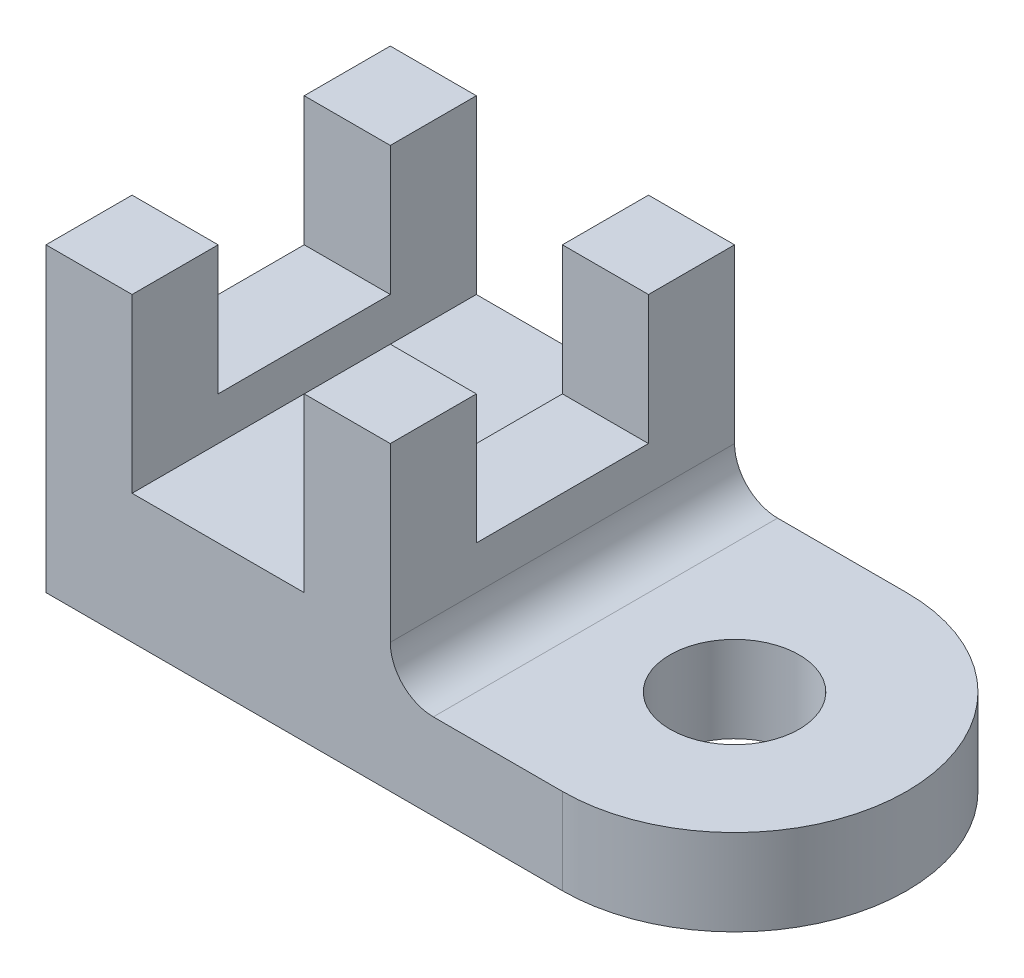
ISO-10303-21;
HEADER;
FILE_DESCRIPTION(('STEP AP214'),'2;1');
FILE_NAME('part.step','',(''),(''),'','','');
FILE_SCHEMA(('AUTOMOTIVE_DESIGN { 1 0 10303 214 1 1 1 1 }'));
ENDSEC;
DATA;
#1=APPLICATION_CONTEXT('core data for automotive mechanical design processes');
#2=APPLICATION_PROTOCOL_DEFINITION('international standard','automotive_design',2000,#1);
#3=PRODUCT_CONTEXT('',#1,'mechanical');
#4=PRODUCT('Part','Part','',(#3));
#5=PRODUCT_RELATED_PRODUCT_CATEGORY('part','',(#4));
#6=PRODUCT_DEFINITION_FORMATION('','',#4);
#7=PRODUCT_DEFINITION_CONTEXT('part definition',#1,'design');
#8=PRODUCT_DEFINITION('design','',#6,#7);
#9=PRODUCT_DEFINITION_SHAPE('','',#8);
#10=(LENGTH_UNIT() NAMED_UNIT(*) SI_UNIT(.MILLI.,.METRE.));
#11=(NAMED_UNIT(*) PLANE_ANGLE_UNIT() SI_UNIT($,.RADIAN.));
#12=(NAMED_UNIT(*) SI_UNIT($,.STERADIAN.) SOLID_ANGLE_UNIT());
#13=UNCERTAINTY_MEASURE_WITH_UNIT(LENGTH_MEASURE(1.E-05),#10,'distance_accuracy_value','');
#14=(GEOMETRIC_REPRESENTATION_CONTEXT(3) GLOBAL_UNCERTAINTY_ASSIGNED_CONTEXT((#13)) GLOBAL_UNIT_ASSIGNED_CONTEXT((#10,
#11,#12)) REPRESENTATION_CONTEXT('',''));
#15=CARTESIAN_POINT('',(0.,0.,0.));
#16=DIRECTION('',(0.,0.,1.));
#17=DIRECTION('',(1.,0.,0.));
#18=AXIS2_PLACEMENT_3D('',#15,#16,#17);
#19=CARTESIAN_POINT('',(12.7,44.45,25.4));
#20=DIRECTION('',(0.,-1.,0.));
#21=DIRECTION('',(1.,0.,0.));
#22=AXIS2_PLACEMENT_3D('',#19,#20,#21);
#23=PLANE('',#22);
#24=DIRECTION('',(1.,0.,0.));
#25=VECTOR('',#24,1.);
#26=CARTESIAN_POINT('',(-38.1,44.45,-12.7));
#27=LINE('',#26,#25);
#28=CARTESIAN_POINT('',(0.,44.45,-12.7));
#29=VERTEX_POINT('',#28);
#30=CARTESIAN_POINT('',(12.7,44.45,-12.7));
#31=VERTEX_POINT('',#30);
#32=EDGE_CURVE('E208',#29,#31,#27,.T.);
#33=ORIENTED_EDGE('',*,*,#32,.T.);
#34=DIRECTION('',(0.,0.,-1.));
#35=VECTOR('',#34,1.);
#36=CARTESIAN_POINT('',(12.7,44.45,25.4));
#37=LINE('',#36,#35);
#38=CARTESIAN_POINT('',(12.7,44.45,-25.4));
#39=VERTEX_POINT('',#38);
#40=EDGE_CURVE('E300',#31,#39,#37,.T.);
#41=ORIENTED_EDGE('',*,*,#40,.T.);
#42=DIRECTION('',(-1.,0.,0.));
#43=VECTOR('',#42,1.);
#44=CARTESIAN_POINT('',(12.7,44.45,-25.4));
#45=LINE('',#44,#43);
#46=CARTESIAN_POINT('',(0.,44.45,-25.4));
#47=VERTEX_POINT('',#46);
#48=EDGE_CURVE('E273',#39,#47,#45,.T.);
#49=ORIENTED_EDGE('',*,*,#48,.T.);
#50=DIRECTION('',(0.,0.,-1.));
#51=VECTOR('',#50,1.);
#52=CARTESIAN_POINT('',(0.,44.45,25.4));
#53=LINE('',#52,#51);
#54=EDGE_CURVE('E296',#29,#47,#53,.T.);
#55=ORIENTED_EDGE('',*,*,#54,.F.);
#56=EDGE_LOOP('',(#33,#41,#49,#55));
#57=FACE_BOUND('',#56,.T.);
#58=ADVANCED_FACE('F37',(#57),#23,.F.);
#59=CARTESIAN_POINT('',(-25.4,44.45,25.4));
#60=DIRECTION('',(0.,-1.,0.));
#61=DIRECTION('',(0.,0.,-1.));
#62=AXIS2_PLACEMENT_3D('',#59,#60,#61);
#63=PLANE('',#62);
#64=CARTESIAN_POINT('',(-38.1,44.45,-12.7));
#65=VERTEX_POINT('',#64);
#66=CARTESIAN_POINT('',(-25.4,44.45,-12.7));
#67=VERTEX_POINT('',#66);
#68=EDGE_CURVE('E206',#65,#67,#27,.T.);
#69=ORIENTED_EDGE('',*,*,#68,.T.);
#70=DIRECTION('',(0.,0.,-1.));
#71=VECTOR('',#70,1.);
#72=CARTESIAN_POINT('',(-25.4,44.45,25.4));
#73=LINE('',#72,#71);
#74=CARTESIAN_POINT('',(-25.4,44.45,-25.4));
#75=VERTEX_POINT('',#74);
#76=EDGE_CURVE('E286',#67,#75,#73,.T.);
#77=ORIENTED_EDGE('',*,*,#76,.T.);
#78=DIRECTION('',(-1.,0.,0.));
#79=VECTOR('',#78,1.);
#80=CARTESIAN_POINT('',(-25.4,44.45,-25.4));
#81=LINE('',#80,#79);
#82=CARTESIAN_POINT('',(-38.1,44.45,-25.4));
#83=VERTEX_POINT('',#82);
#84=EDGE_CURVE('E237',#75,#83,#81,.T.);
#85=ORIENTED_EDGE('',*,*,#84,.T.);
#86=DIRECTION('',(0.,0.,-1.));
#87=VECTOR('',#86,1.);
#88=CARTESIAN_POINT('',(-38.1,44.45,25.4));
#89=LINE('',#88,#87);
#90=EDGE_CURVE('E257',#65,#83,#89,.T.);
#91=ORIENTED_EDGE('',*,*,#90,.F.);
#92=EDGE_LOOP('',(#69,#77,#85,#91));
#93=FACE_BOUND('',#92,.T.);
#94=ADVANCED_FACE('F364',(#93),#63,.F.);
#95=CARTESIAN_POINT('',(-38.1,44.45,25.4));
#96=DIRECTION('',(1.,0.,0.));
#97=DIRECTION('',(0.,1.,0.));
#98=AXIS2_PLACEMENT_3D('',#95,#96,#97);
#99=PLANE('',#98);
#100=CARTESIAN_POINT('',(-38.1,44.45,25.4));
#101=VERTEX_POINT('',#100);
#102=CARTESIAN_POINT('',(-38.1,44.45,12.7));
#103=VERTEX_POINT('',#102);
#104=EDGE_CURVE('E191',#101,#103,#89,.T.);
#105=ORIENTED_EDGE('',*,*,#104,.T.);
#106=DIRECTION('',(0.,-1.,0.));
#107=VECTOR('',#106,1.);
#108=CARTESIAN_POINT('',(-38.1,44.45,12.7));
#109=LINE('',#108,#107);
#110=CARTESIAN_POINT('',(-38.1,25.4,12.7));
#111=VERTEX_POINT('',#110);
#112=EDGE_CURVE('E172',#103,#111,#109,.T.);
#113=ORIENTED_EDGE('',*,*,#112,.T.);
#114=DIRECTION('',(0.,0.,-1.));
#115=VECTOR('',#114,1.);
#116=CARTESIAN_POINT('',(-38.1,25.4,12.7));
#117=LINE('',#116,#115);
#118=CARTESIAN_POINT('',(-38.1,25.4,-12.7));
#119=VERTEX_POINT('',#118);
#120=EDGE_CURVE('E181',#111,#119,#117,.T.);
#121=ORIENTED_EDGE('',*,*,#120,.T.);
#122=DIRECTION('',(0.,-1.,0.));
#123=VECTOR('',#122,1.);
#124=CARTESIAN_POINT('',(-38.1,44.45,-12.7));
#125=LINE('',#124,#123);
#126=EDGE_CURVE('E186',#65,#119,#125,.T.);
#127=ORIENTED_EDGE('',*,*,#126,.F.);
#128=ORIENTED_EDGE('',*,*,#90,.T.);
#129=DIRECTION('',(0.,-1.,0.));
#130=VECTOR('',#129,1.);
#131=CARTESIAN_POINT('',(-38.1,44.45,-25.4));
#132=LINE('',#131,#130);
#133=CARTESIAN_POINT('',(-38.1,0.,-25.4));
#134=VERTEX_POINT('',#133);
#135=EDGE_CURVE('E232',#83,#134,#132,.T.);
#136=ORIENTED_EDGE('',*,*,#135,.T.);
#137=DIRECTION('',(0.,0.,-1.));
#138=VECTOR('',#137,1.);
#139=CARTESIAN_POINT('',(-38.1,0.,25.4));
#140=LINE('',#139,#138);
#141=CARTESIAN_POINT('',(-38.1,0.,25.4));
#142=VERTEX_POINT('',#141);
#143=EDGE_CURVE('E45',#142,#134,#140,.T.);
#144=ORIENTED_EDGE('',*,*,#143,.F.);
#145=DIRECTION('',(0.,-1.,0.));
#146=VECTOR('',#145,1.);
#147=CARTESIAN_POINT('',(-38.1,44.45,25.4));
#148=LINE('',#147,#146);
#149=EDGE_CURVE('E233',#101,#142,#148,.T.);
#150=ORIENTED_EDGE('',*,*,#149,.F.);
#151=EDGE_LOOP('',(#105,#113,#121,#127,#128,#136,#144,#150));
#152=FACE_BOUND('',#151,.T.);
#153=ADVANCED_FACE('F39',(#152),#99,.F.);
#154=CARTESIAN_POINT('',(-38.1,0.,25.4));
#155=DIRECTION('',(0.,1.,0.));
#156=DIRECTION('',(-1.,0.,0.));
#157=AXIS2_PLACEMENT_3D('',#154,#155,#156);
#158=PLANE('',#157);
#159=CARTESIAN_POINT('',(38.1,0.,0.));
#160=DIRECTION('',(0.,1.,0.));
#161=DIRECTION('',(0.,0.,1.));
#162=AXIS2_PLACEMENT_3D('',#159,#160,#161);
#163=CIRCLE('',#162,9.52499999999998);
#164=CARTESIAN_POINT('',(38.1,0.,9.52499999999998));
#165=VERTEX_POINT('',#164);
#166=EDGE_CURVE('E223',#165,#165,#163,.T.);
#167=ORIENTED_EDGE('',*,*,#166,.T.);
#168=EDGE_LOOP('',(#167));
#169=FACE_BOUND('',#168,.T.);
#170=DIRECTION('',(1.,0.,0.));
#171=VECTOR('',#170,1.);
#172=CARTESIAN_POINT('',(-38.1,0.,-25.4));
#173=LINE('',#172,#171);
#174=CARTESIAN_POINT('',(38.1,0.,-25.4));
#175=VERTEX_POINT('',#174);
#176=EDGE_CURVE('E260',#134,#175,#173,.T.);
#177=ORIENTED_EDGE('',*,*,#176,.T.);
#178=CARTESIAN_POINT('',(38.1,0.,0.));
#179=DIRECTION('',(0.,-1.,0.));
#180=DIRECTION('',(1.,0.,0.));
#181=AXIS2_PLACEMENT_3D('',#178,#179,#180);
#182=CIRCLE('',#181,25.4);
#183=CARTESIAN_POINT('',(38.1,0.,25.4));
#184=VERTEX_POINT('',#183);
#185=EDGE_CURVE('E226',#175,#184,#182,.T.);
#186=ORIENTED_EDGE('',*,*,#185,.T.);
#187=DIRECTION('',(1.,0.,0.));
#188=VECTOR('',#187,1.);
#189=CARTESIAN_POINT('',(-38.1,0.,25.4));
#190=LINE('',#189,#188);
#191=EDGE_CURVE('E236',#142,#184,#190,.T.);
#192=ORIENTED_EDGE('',*,*,#191,.F.);
#193=ORIENTED_EDGE('',*,*,#143,.T.);
#194=EDGE_LOOP('',(#177,#186,#192,#193));
#195=FACE_BOUND('',#194,.T.);
#196=ADVANCED_FACE('F311',(#169,#195),#158,.F.);
#197=CARTESIAN_POINT('',(38.1,12.7,25.4));
#198=DIRECTION('',(0.,-1.,0.));
#199=DIRECTION('',(1.,0.,0.));
#200=AXIS2_PLACEMENT_3D('',#197,#198,#199);
#201=PLANE('',#200);
#202=CARTESIAN_POINT('',(38.1,12.7,0.));
#203=DIRECTION('',(0.,1.,0.));
#204=DIRECTION('',(0.,0.,1.));
#205=AXIS2_PLACEMENT_3D('',#202,#203,#204);
#206=CIRCLE('',#205,9.52499999999998);
#207=CARTESIAN_POINT('',(38.1,12.7,9.52499999999998));
#208=VERTEX_POINT('',#207);
#209=EDGE_CURVE('E220',#208,#208,#206,.T.);
#210=ORIENTED_EDGE('',*,*,#209,.F.);
#211=EDGE_LOOP('',(#210));
#212=FACE_BOUND('',#211,.T.);
#213=DIRECTION('',(-1.,0.,0.));
#214=VECTOR('',#213,1.);
#215=CARTESIAN_POINT('',(38.1,12.7,-25.4));
#216=LINE('',#215,#214);
#217=CARTESIAN_POINT('',(38.1,12.7,-25.4));
#218=VERTEX_POINT('',#217);
#219=CARTESIAN_POINT('',(19.05,12.7,-25.4));
#220=VERTEX_POINT('',#219);
#221=EDGE_CURVE('E265',#218,#220,#216,.T.);
#222=ORIENTED_EDGE('',*,*,#221,.T.);
#223=DIRECTION('',(0.,0.,-1.));
#224=VECTOR('',#223,1.);
#225=CARTESIAN_POINT('',(19.05,12.7,25.4));
#226=LINE('',#225,#224);
#227=CARTESIAN_POINT('',(19.05,12.7,25.4));
#228=VERTEX_POINT('',#227);
#229=EDGE_CURVE('E307',#228,#220,#226,.T.);
#230=ORIENTED_EDGE('',*,*,#229,.F.);
#231=DIRECTION('',(-1.,0.,0.));
#232=VECTOR('',#231,1.);
#233=CARTESIAN_POINT('',(38.1,12.7,25.4));
#234=LINE('',#233,#232);
#235=CARTESIAN_POINT('',(38.1,12.7,25.4));
#236=VERTEX_POINT('',#235);
#237=EDGE_CURVE('E241',#236,#228,#234,.T.);
#238=ORIENTED_EDGE('',*,*,#237,.F.);
#239=CARTESIAN_POINT('',(38.1,12.7,0.));
#240=DIRECTION('',(0.,-1.,0.));
#241=DIRECTION('',(1.,0.,0.));
#242=AXIS2_PLACEMENT_3D('',#239,#240,#241);
#243=CIRCLE('',#242,25.4);
#244=EDGE_CURVE('E229',#236,#218,#243,.F.);
#245=ORIENTED_EDGE('',*,*,#244,.T.);
#246=EDGE_LOOP('',(#222,#230,#238,#245));
#247=FACE_BOUND('',#246,.T.);
#248=ADVANCED_FACE('F330',(#212,#247),#201,.F.);
#249=CARTESIAN_POINT('',(19.05,19.05,25.4));
#250=DIRECTION('',(0.,0.,-1.));
#251=DIRECTION('',(-1.,0.,0.));
#252=AXIS2_PLACEMENT_3D('',#249,#250,#251);
#253=CYLINDRICAL_SURFACE('',#252,6.35);
#254=CARTESIAN_POINT('',(19.05,19.05,-25.4));
#255=DIRECTION('',(0.,0.,-1.));
#256=DIRECTION('',(1.,0.,0.));
#257=AXIS2_PLACEMENT_3D('',#254,#255,#256);
#258=CIRCLE('',#257,6.35);
#259=CARTESIAN_POINT('',(12.7,19.0500000000001,-25.4));
#260=VERTEX_POINT('',#259);
#261=EDGE_CURVE('E268',#220,#260,#258,.T.);
#262=ORIENTED_EDGE('',*,*,#261,.T.);
#263=DIRECTION('',(0.,0.,-1.));
#264=VECTOR('',#263,1.);
#265=CARTESIAN_POINT('',(12.7,19.0500000000001,25.4));
#266=LINE('',#265,#264);
#267=CARTESIAN_POINT('',(12.7,19.0500000000001,25.4));
#268=VERTEX_POINT('',#267);
#269=EDGE_CURVE('E304',#268,#260,#266,.T.);
#270=ORIENTED_EDGE('',*,*,#269,.F.);
#271=CARTESIAN_POINT('',(19.05,19.05,25.4));
#272=DIRECTION('',(0.,0.,-1.));
#273=DIRECTION('',(1.,0.,0.));
#274=AXIS2_PLACEMENT_3D('',#271,#272,#273);
#275=CIRCLE('',#274,6.35);
#276=EDGE_CURVE('E243',#228,#268,#275,.T.);
#277=ORIENTED_EDGE('',*,*,#276,.F.);
#278=ORIENTED_EDGE('',*,*,#229,.T.);
#279=EDGE_LOOP('',(#262,#270,#277,#278));
#280=FACE_BOUND('',#279,.T.);
#281=ADVANCED_FACE('F334',(#280),#253,.F.);
#282=CARTESIAN_POINT('',(12.7,19.0500000000001,25.4));
#283=DIRECTION('',(-1.,0.,0.));
#284=DIRECTION('',(0.,0.,1.));
#285=AXIS2_PLACEMENT_3D('',#282,#283,#284);
#286=PLANE('',#285);
#287=DIRECTION('',(0.,0.,-1.));
#288=VECTOR('',#287,1.);
#289=CARTESIAN_POINT('',(12.7,25.4,12.7));
#290=LINE('',#289,#288);
#291=CARTESIAN_POINT('',(12.7,25.4,12.7));
#292=VERTEX_POINT('',#291);
#293=CARTESIAN_POINT('',(12.7,25.4,-12.7));
#294=VERTEX_POINT('',#293);
#295=EDGE_CURVE('E195',#292,#294,#290,.T.);
#296=ORIENTED_EDGE('',*,*,#295,.F.);
#297=DIRECTION('',(0.,-1.,0.));
#298=VECTOR('',#297,1.);
#299=CARTESIAN_POINT('',(12.7,44.45,12.7));
#300=LINE('',#299,#298);
#301=CARTESIAN_POINT('',(12.7,44.45,12.7));
#302=VERTEX_POINT('',#301);
#303=EDGE_CURVE('E199',#302,#292,#300,.T.);
#304=ORIENTED_EDGE('',*,*,#303,.F.);
#305=CARTESIAN_POINT('',(12.7,44.45,25.4));
#306=VERTEX_POINT('',#305);
#307=EDGE_CURVE('E301',#306,#302,#37,.T.);
#308=ORIENTED_EDGE('',*,*,#307,.F.);
#309=DIRECTION('',(0.,1.,0.));
#310=VECTOR('',#309,1.);
#311=CARTESIAN_POINT('',(12.7,19.0500000000001,25.4));
#312=LINE('',#311,#310);
#313=EDGE_CURVE('E245',#268,#306,#312,.T.);
#314=ORIENTED_EDGE('',*,*,#313,.F.);
#315=ORIENTED_EDGE('',*,*,#269,.T.);
#316=DIRECTION('',(0.,1.,0.));
#317=VECTOR('',#316,1.);
#318=CARTESIAN_POINT('',(12.7,19.0500000000001,-25.4));
#319=LINE('',#318,#317);
#320=EDGE_CURVE('E270',#260,#39,#319,.T.);
#321=ORIENTED_EDGE('',*,*,#320,.T.);
#322=ORIENTED_EDGE('',*,*,#40,.F.);
#323=DIRECTION('',(0.,-1.,0.));
#324=VECTOR('',#323,1.);
#325=CARTESIAN_POINT('',(12.7,44.45,-12.7));
#326=LINE('',#325,#324);
#327=EDGE_CURVE('E192',#31,#294,#326,.T.);
#328=ORIENTED_EDGE('',*,*,#327,.T.);
#329=EDGE_LOOP('',(#296,#304,#308,#314,#315,#321,#322,#328));
#330=FACE_BOUND('',#329,.T.);
#331=ADVANCED_FACE('F342',(#330),#286,.F.);
#332=ORIENTED_EDGE('',*,*,#307,.T.);
#333=DIRECTION('',(1.,0.,0.));
#334=VECTOR('',#333,1.);
#335=CARTESIAN_POINT('',(-38.1,44.45,12.7));
#336=LINE('',#335,#334);
#337=CARTESIAN_POINT('',(0.,44.45,12.7));
#338=VERTEX_POINT('',#337);
#339=EDGE_CURVE('E205',#338,#302,#336,.T.);
#340=ORIENTED_EDGE('',*,*,#339,.F.);
#341=CARTESIAN_POINT('',(0.,44.45,25.4));
#342=VERTEX_POINT('',#341);
#343=EDGE_CURVE('E297',#342,#338,#53,.T.);
#344=ORIENTED_EDGE('',*,*,#343,.F.);
#345=DIRECTION('',(-1.,0.,0.));
#346=VECTOR('',#345,1.);
#347=CARTESIAN_POINT('',(12.7,44.45,25.4));
#348=LINE('',#347,#346);
#349=EDGE_CURVE('E247',#306,#342,#348,.T.);
#350=ORIENTED_EDGE('',*,*,#349,.F.);
#351=EDGE_LOOP('',(#332,#340,#344,#350));
#352=FACE_BOUND('',#351,.T.);
#353=ADVANCED_FACE('F345',(#352),#23,.F.);
#354=CARTESIAN_POINT('',(0.,44.45,25.4));
#355=DIRECTION('',(1.,0.,0.));
#356=DIRECTION('',(0.,1.,0.));
#357=AXIS2_PLACEMENT_3D('',#354,#355,#356);
#358=PLANE('',#357);
#359=ORIENTED_EDGE('',*,*,#343,.T.);
#360=DIRECTION('',(0.,-1.,0.));
#361=VECTOR('',#360,1.);
#362=CARTESIAN_POINT('',(0.,44.45,12.7));
#363=LINE('',#362,#361);
#364=CARTESIAN_POINT('',(0.,25.4,12.7));
#365=VERTEX_POINT('',#364);
#366=EDGE_CURVE('E214',#338,#365,#363,.T.);
#367=ORIENTED_EDGE('',*,*,#366,.T.);
#368=DIRECTION('',(0.,0.,-1.));
#369=VECTOR('',#368,1.);
#370=CARTESIAN_POINT('',(0.,25.4,25.4));
#371=LINE('',#370,#369);
#372=CARTESIAN_POINT('',(0.,25.4,-12.7));
#373=VERTEX_POINT('',#372);
#374=EDGE_CURVE('E217',#365,#373,#371,.T.);
#375=ORIENTED_EDGE('',*,*,#374,.T.);
#376=DIRECTION('',(0.,-1.,0.));
#377=VECTOR('',#376,1.);
#378=CARTESIAN_POINT('',(0.,44.45,-12.7));
#379=LINE('',#378,#377);
#380=EDGE_CURVE('E211',#29,#373,#379,.T.);
#381=ORIENTED_EDGE('',*,*,#380,.F.);
#382=ORIENTED_EDGE('',*,*,#54,.T.);
#383=DIRECTION('',(0.,-1.,0.));
#384=VECTOR('',#383,1.);
#385=CARTESIAN_POINT('',(0.,44.45,-25.4));
#386=LINE('',#385,#384);
#387=CARTESIAN_POINT('',(0.,19.05,-25.4));
#388=VERTEX_POINT('',#387);
#389=EDGE_CURVE('E276',#47,#388,#386,.T.);
#390=ORIENTED_EDGE('',*,*,#389,.T.);
#391=DIRECTION('',(0.,0.,-1.));
#392=VECTOR('',#391,1.);
#393=CARTESIAN_POINT('',(0.,19.05,25.4));
#394=LINE('',#393,#392);
#395=CARTESIAN_POINT('',(0.,19.05,25.4));
#396=VERTEX_POINT('',#395);
#397=EDGE_CURVE('E293',#396,#388,#394,.T.);
#398=ORIENTED_EDGE('',*,*,#397,.F.);
#399=DIRECTION('',(0.,-1.,0.));
#400=VECTOR('',#399,1.);
#401=CARTESIAN_POINT('',(0.,44.45,25.4));
#402=LINE('',#401,#400);
#403=EDGE_CURVE('E249',#342,#396,#402,.T.);
#404=ORIENTED_EDGE('',*,*,#403,.F.);
#405=EDGE_LOOP('',(#359,#367,#375,#381,#382,#390,#398,#404));
#406=FACE_BOUND('',#405,.T.);
#407=ADVANCED_FACE('F349',(#406),#358,.F.);
#408=CARTESIAN_POINT('',(0.,19.05,25.4));
#409=DIRECTION('',(0.,-1.,0.));
#410=DIRECTION('',(1.,0.,0.));
#411=AXIS2_PLACEMENT_3D('',#408,#409,#410);
#412=PLANE('',#411);
#413=DIRECTION('',(-1.,0.,0.));
#414=VECTOR('',#413,1.);
#415=CARTESIAN_POINT('',(0.,19.05,-25.4));
#416=LINE('',#415,#414);
#417=CARTESIAN_POINT('',(-25.4,19.05,-25.4));
#418=VERTEX_POINT('',#417);
#419=EDGE_CURVE('E278',#388,#418,#416,.T.);
#420=ORIENTED_EDGE('',*,*,#419,.T.);
#421=DIRECTION('',(0.,0.,-1.));
#422=VECTOR('',#421,1.);
#423=CARTESIAN_POINT('',(-25.4,19.05,25.4));
#424=LINE('',#423,#422);
#425=CARTESIAN_POINT('',(-25.4,19.05,25.4));
#426=VERTEX_POINT('',#425);
#427=EDGE_CURVE('E290',#426,#418,#424,.T.);
#428=ORIENTED_EDGE('',*,*,#427,.F.);
#429=DIRECTION('',(-1.,0.,0.));
#430=VECTOR('',#429,1.);
#431=CARTESIAN_POINT('',(0.,19.05,25.4));
#432=LINE('',#431,#430);
#433=EDGE_CURVE('E251',#396,#426,#432,.T.);
#434=ORIENTED_EDGE('',*,*,#433,.F.);
#435=ORIENTED_EDGE('',*,*,#397,.T.);
#436=EDGE_LOOP('',(#420,#428,#434,#435));
#437=FACE_BOUND('',#436,.T.);
#438=ADVANCED_FACE('F355',(#437),#412,.F.);
#439=CARTESIAN_POINT('',(-25.4,19.05,25.4));
#440=DIRECTION('',(-1.,0.,0.));
#441=DIRECTION('',(0.,-1.,0.));
#442=AXIS2_PLACEMENT_3D('',#439,#440,#441);
#443=PLANE('',#442);
#444=DIRECTION('',(0.,0.,1.));
#445=VECTOR('',#444,1.);
#446=CARTESIAN_POINT('',(-25.4,25.4,25.4));
#447=LINE('',#446,#445);
#448=CARTESIAN_POINT('',(-25.4,25.4,-12.7));
#449=VERTEX_POINT('',#448);
#450=CARTESIAN_POINT('',(-25.4,25.4,12.7));
#451=VERTEX_POINT('',#450);
#452=EDGE_CURVE('E11',#449,#451,#447,.T.);
#453=ORIENTED_EDGE('',*,*,#452,.T.);
#454=DIRECTION('',(0.,1.,0.));
#455=VECTOR('',#454,1.);
#456=CARTESIAN_POINT('',(-25.4,19.05,12.7));
#457=LINE('',#456,#455);
#458=CARTESIAN_POINT('',(-25.4,44.45,12.7));
#459=VERTEX_POINT('',#458);
#460=EDGE_CURVE('E175',#451,#459,#457,.T.);
#461=ORIENTED_EDGE('',*,*,#460,.T.);
#462=CARTESIAN_POINT('',(-25.4,44.45,25.4));
#463=VERTEX_POINT('',#462);
#464=EDGE_CURVE('E287',#463,#459,#73,.T.);
#465=ORIENTED_EDGE('',*,*,#464,.F.);
#466=DIRECTION('',(0.,1.,0.));
#467=VECTOR('',#466,1.);
#468=CARTESIAN_POINT('',(-25.4,19.05,25.4));
#469=LINE('',#468,#467);
#470=EDGE_CURVE('E253',#426,#463,#469,.T.);
#471=ORIENTED_EDGE('',*,*,#470,.F.);
#472=ORIENTED_EDGE('',*,*,#427,.T.);
#473=DIRECTION('',(0.,1.,0.));
#474=VECTOR('',#473,1.);
#475=CARTESIAN_POINT('',(-25.4,19.05,-25.4));
#476=LINE('',#475,#474);
#477=EDGE_CURVE('E280',#418,#75,#476,.T.);
#478=ORIENTED_EDGE('',*,*,#477,.T.);
#479=ORIENTED_EDGE('',*,*,#76,.F.);
#480=DIRECTION('',(0.,1.,0.));
#481=VECTOR('',#480,1.);
#482=CARTESIAN_POINT('',(-25.4,19.05,-12.7));
#483=LINE('',#482,#481);
#484=EDGE_CURVE('E60',#449,#67,#483,.T.);
#485=ORIENTED_EDGE('',*,*,#484,.F.);
#486=EDGE_LOOP('',(#453,#461,#465,#471,#472,#478,#479,#485));
#487=FACE_BOUND('',#486,.T.);
#488=ADVANCED_FACE('F358',(#487),#443,.F.);
#489=ORIENTED_EDGE('',*,*,#464,.T.);
#490=EDGE_CURVE('E203',#103,#459,#336,.T.);
#491=ORIENTED_EDGE('',*,*,#490,.F.);
#492=ORIENTED_EDGE('',*,*,#104,.F.);
#493=DIRECTION('',(-1.,0.,0.));
#494=VECTOR('',#493,1.);
#495=CARTESIAN_POINT('',(-25.4,44.45,25.4));
#496=LINE('',#495,#494);
#497=EDGE_CURVE('E255',#463,#101,#496,.T.);
#498=ORIENTED_EDGE('',*,*,#497,.F.);
#499=EDGE_LOOP('',(#489,#491,#492,#498));
#500=FACE_BOUND('',#499,.T.);
#501=ADVANCED_FACE('F361',(#500),#63,.F.);
#502=CARTESIAN_POINT('',(19.05,19.05,25.4));
#503=DIRECTION('',(0.,0.,1.));
#504=DIRECTION('',(1.,0.,0.));
#505=AXIS2_PLACEMENT_3D('',#502,#503,#504);
#506=PLANE('',#505);
#507=ORIENTED_EDGE('',*,*,#149,.T.);
#508=ORIENTED_EDGE('',*,*,#191,.T.);
#509=DIRECTION('',(0.,1.,0.));
#510=VECTOR('',#509,1.);
#511=CARTESIAN_POINT('',(38.1,0.,25.4));
#512=LINE('',#511,#510);
#513=EDGE_CURVE('E239',#184,#236,#512,.T.);
#514=ORIENTED_EDGE('',*,*,#513,.T.);
#515=ORIENTED_EDGE('',*,*,#237,.T.);
#516=ORIENTED_EDGE('',*,*,#276,.T.);
#517=ORIENTED_EDGE('',*,*,#313,.T.);
#518=ORIENTED_EDGE('',*,*,#349,.T.);
#519=ORIENTED_EDGE('',*,*,#403,.T.);
#520=ORIENTED_EDGE('',*,*,#433,.T.);
#521=ORIENTED_EDGE('',*,*,#470,.T.);
#522=ORIENTED_EDGE('',*,*,#497,.T.);
#523=EDGE_LOOP('',(#507,#508,#514,#515,#516,#517,#518,#519,#520,#521,#522));
#524=FACE_BOUND('',#523,.T.);
#525=ADVANCED_FACE('F327',(#524),#506,.T.);
#526=CARTESIAN_POINT('',(19.05,19.05,-25.4));
#527=DIRECTION('',(0.,0.,1.));
#528=DIRECTION('',(1.,0.,0.));
#529=AXIS2_PLACEMENT_3D('',#526,#527,#528);
#530=PLANE('',#529);
#531=ORIENTED_EDGE('',*,*,#135,.F.);
#532=ORIENTED_EDGE('',*,*,#84,.F.);
#533=ORIENTED_EDGE('',*,*,#477,.F.);
#534=ORIENTED_EDGE('',*,*,#419,.F.);
#535=ORIENTED_EDGE('',*,*,#389,.F.);
#536=ORIENTED_EDGE('',*,*,#48,.F.);
#537=ORIENTED_EDGE('',*,*,#320,.F.);
#538=ORIENTED_EDGE('',*,*,#261,.F.);
#539=ORIENTED_EDGE('',*,*,#221,.F.);
#540=DIRECTION('',(0.,1.,0.));
#541=VECTOR('',#540,1.);
#542=CARTESIAN_POINT('',(38.1,0.,-25.4));
#543=LINE('',#542,#541);
#544=EDGE_CURVE('E262',#175,#218,#543,.T.);
#545=ORIENTED_EDGE('',*,*,#544,.F.);
#546=ORIENTED_EDGE('',*,*,#176,.F.);
#547=EDGE_LOOP('',(#531,#532,#533,#534,#535,#536,#537,#538,#539,#545,#546));
#548=FACE_BOUND('',#547,.T.);
#549=ADVANCED_FACE('F317',(#548),#530,.F.);
#550=CARTESIAN_POINT('',(38.1,84.5420489685532,0.));
#551=DIRECTION('',(0.,-1.,0.));
#552=DIRECTION('',(1.,0.,0.));
#553=AXIS2_PLACEMENT_3D('',#550,#551,#552);
#554=CYLINDRICAL_SURFACE('',#553,25.4);
#555=ORIENTED_EDGE('',*,*,#244,.F.);
#556=ORIENTED_EDGE('',*,*,#513,.F.);
#557=ORIENTED_EDGE('',*,*,#185,.F.);
#558=ORIENTED_EDGE('',*,*,#544,.T.);
#559=EDGE_LOOP('',(#555,#556,#557,#558));
#560=FACE_BOUND('',#559,.T.);
#561=ADVANCED_FACE('F324',(#560),#554,.T.);
#562=CARTESIAN_POINT('',(38.1,12.7,0.));
#563=DIRECTION('',(0.,1.,0.));
#564=DIRECTION('',(0.,0.,1.));
#565=AXIS2_PLACEMENT_3D('',#562,#563,#564);
#566=CYLINDRICAL_SURFACE('',#565,9.52499999999998);
#567=ORIENTED_EDGE('',*,*,#166,.F.);
#568=EDGE_LOOP('',(#567));
#569=FACE_BOUND('',#568,.T.);
#570=ORIENTED_EDGE('',*,*,#209,.T.);
#571=EDGE_LOOP('',(#570));
#572=FACE_BOUND('',#571,.T.);
#573=ADVANCED_FACE('F401',(#569,#572),#566,.F.);
#574=CARTESIAN_POINT('',(-38.1,44.45,12.7));
#575=DIRECTION('',(0.,0.,1.));
#576=DIRECTION('',(0.,-1.,0.));
#577=AXIS2_PLACEMENT_3D('',#574,#575,#576);
#578=PLANE('',#577);
#579=DIRECTION('',(1.,0.,0.));
#580=VECTOR('',#579,1.);
#581=CARTESIAN_POINT('',(-38.1,25.4,12.7));
#582=LINE('',#581,#580);
#583=EDGE_CURVE('E168',#111,#451,#582,.T.);
#584=ORIENTED_EDGE('',*,*,#583,.F.);
#585=ORIENTED_EDGE('',*,*,#112,.F.);
#586=ORIENTED_EDGE('',*,*,#490,.T.);
#587=ORIENTED_EDGE('',*,*,#460,.F.);
#588=EDGE_LOOP('',(#584,#585,#586,#587));
#589=FACE_BOUND('',#588,.T.);
#590=ADVANCED_FACE('F170',(#589),#578,.F.);
#591=CARTESIAN_POINT('',(-38.1,44.45,-12.7));
#592=DIRECTION('',(0.,0.,1.));
#593=DIRECTION('',(0.,-1.,0.));
#594=AXIS2_PLACEMENT_3D('',#591,#592,#593);
#595=PLANE('',#594);
#596=ORIENTED_EDGE('',*,*,#484,.T.);
#597=ORIENTED_EDGE('',*,*,#68,.F.);
#598=ORIENTED_EDGE('',*,*,#126,.T.);
#599=DIRECTION('',(1.,0.,0.));
#600=VECTOR('',#599,1.);
#601=CARTESIAN_POINT('',(-38.1,25.4,-12.7));
#602=LINE('',#601,#600);
#603=EDGE_CURVE('E183',#119,#449,#602,.T.);
#604=ORIENTED_EDGE('',*,*,#603,.T.);
#605=EDGE_LOOP('',(#596,#597,#598,#604));
#606=FACE_BOUND('',#605,.T.);
#607=ADVANCED_FACE('F410',(#606),#595,.T.);
#608=CARTESIAN_POINT('',(-38.1,25.4,12.7));
#609=DIRECTION('',(0.,-1.,0.));
#610=DIRECTION('',(0.,0.,-1.));
#611=AXIS2_PLACEMENT_3D('',#608,#609,#610);
#612=PLANE('',#611);
#613=ORIENTED_EDGE('',*,*,#603,.F.);
#614=ORIENTED_EDGE('',*,*,#120,.F.);
#615=ORIENTED_EDGE('',*,*,#583,.T.);
#616=ORIENTED_EDGE('',*,*,#452,.F.);
#617=EDGE_LOOP('',(#613,#614,#615,#616));
#618=FACE_BOUND('',#617,.T.);
#619=ADVANCED_FACE('F182',(#618),#612,.F.);
#620=EDGE_CURVE('E177',#365,#292,#582,.T.);
#621=ORIENTED_EDGE('',*,*,#620,.T.);
#622=ORIENTED_EDGE('',*,*,#295,.T.);
#623=EDGE_CURVE('E52',#373,#294,#602,.T.);
#624=ORIENTED_EDGE('',*,*,#623,.F.);
#625=ORIENTED_EDGE('',*,*,#374,.F.);
#626=EDGE_LOOP('',(#621,#622,#624,#625));
#627=FACE_BOUND('',#626,.T.);
#628=ADVANCED_FACE('F508',(#627),#612,.F.);
#629=ORIENTED_EDGE('',*,*,#339,.T.);
#630=ORIENTED_EDGE('',*,*,#303,.T.);
#631=ORIENTED_EDGE('',*,*,#620,.F.);
#632=ORIENTED_EDGE('',*,*,#366,.F.);
#633=EDGE_LOOP('',(#629,#630,#631,#632));
#634=FACE_BOUND('',#633,.T.);
#635=ADVANCED_FACE('F412',(#634),#578,.F.);
#636=ORIENTED_EDGE('',*,*,#380,.T.);
#637=ORIENTED_EDGE('',*,*,#623,.T.);
#638=ORIENTED_EDGE('',*,*,#327,.F.);
#639=ORIENTED_EDGE('',*,*,#32,.F.);
#640=EDGE_LOOP('',(#636,#637,#638,#639));
#641=FACE_BOUND('',#640,.T.);
#642=ADVANCED_FACE('F500',(#641),#595,.T.);
#643=CLOSED_SHELL('',(#58,#94,#153,#196,#248,#281,#331,#353,#407,#438,#488,#501,#525,#549,#561,
#573,#590,#607,#619,#628,#635,#642));
#644=MANIFOLD_SOLID_BREP('B2',#643);
#645=ADVANCED_BREP_SHAPE_REPRESENTATION('',(#18,#644),#14);
#646=SHAPE_DEFINITION_REPRESENTATION(#9,#645);
ENDSEC;
END-ISO-10303-21;
